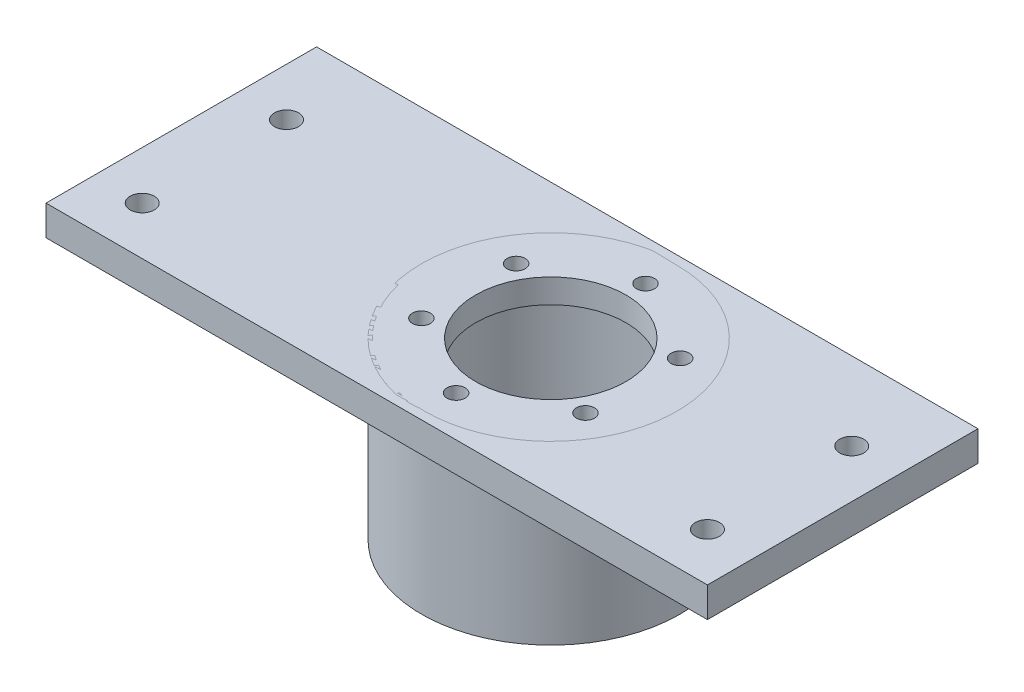
ISO-10303-21;
HEADER;
FILE_DESCRIPTION(('STEP AP214'),'2;1');
FILE_NAME('part.step','',(''),(''),'','','');
FILE_SCHEMA(('AUTOMOTIVE_DESIGN { 1 0 10303 214 1 1 1 1 }'));
ENDSEC;
DATA;
#1=APPLICATION_CONTEXT('core data for automotive mechanical design processes');
#2=APPLICATION_PROTOCOL_DEFINITION('international standard','automotive_design',2000,#1);
#3=PRODUCT_CONTEXT('',#1,'mechanical');
#4=PRODUCT('Part','Part','',(#3));
#5=PRODUCT_RELATED_PRODUCT_CATEGORY('part','',(#4));
#6=PRODUCT_DEFINITION_FORMATION('','',#4);
#7=PRODUCT_DEFINITION_CONTEXT('part definition',#1,'design');
#8=PRODUCT_DEFINITION('design','',#6,#7);
#9=PRODUCT_DEFINITION_SHAPE('','',#8);
#10=(LENGTH_UNIT() NAMED_UNIT(*) SI_UNIT(.MILLI.,.METRE.));
#11=(NAMED_UNIT(*) PLANE_ANGLE_UNIT() SI_UNIT($,.RADIAN.));
#12=(NAMED_UNIT(*) SI_UNIT($,.STERADIAN.) SOLID_ANGLE_UNIT());
#13=UNCERTAINTY_MEASURE_WITH_UNIT(LENGTH_MEASURE(1.E-05),#10,'distance_accuracy_value','');
#14=(GEOMETRIC_REPRESENTATION_CONTEXT(3) GLOBAL_UNCERTAINTY_ASSIGNED_CONTEXT((#13)) GLOBAL_UNIT_ASSIGNED_CONTEXT((#10,
#11,#12)) REPRESENTATION_CONTEXT('',''));
#15=CARTESIAN_POINT('',(0.,0.,0.));
#16=DIRECTION('',(0.,0.,1.));
#17=DIRECTION('',(1.,0.,0.));
#18=AXIS2_PLACEMENT_3D('',#15,#16,#17);
#19=CARTESIAN_POINT('',(0.,-24.,0.));
#20=DIRECTION('',(0.,-1.,0.));
#21=DIRECTION('',(1.,0.,0.));
#22=AXIS2_PLACEMENT_3D('',#19,#20,#21);
#23=PLANE('',#22);
#24=CARTESIAN_POINT('',(0.,-24.,0.));
#25=DIRECTION('',(0.,-1.,0.));
#26=DIRECTION('',(1.,0.,0.));
#27=AXIS2_PLACEMENT_3D('',#24,#25,#26);
#28=CIRCLE('',#27,21.5);
#29=CARTESIAN_POINT('',(21.5,-24.,0.));
#30=VERTEX_POINT('',#29);
#31=EDGE_CURVE('E11',#30,#30,#28,.T.);
#32=ORIENTED_EDGE('',*,*,#31,.T.);
#33=EDGE_LOOP('',(#32));
#34=FACE_BOUND('',#33,.T.);
#35=CARTESIAN_POINT('',(0.,-24.,0.));
#36=DIRECTION('',(0.,-1.,0.));
#37=DIRECTION('',(1.,0.,0.));
#38=AXIS2_PLACEMENT_3D('',#35,#36,#37);
#39=CIRCLE('',#38,19.);
#40=CARTESIAN_POINT('',(19.,-24.,0.));
#41=VERTEX_POINT('',#40);
#42=EDGE_CURVE('E54',#41,#41,#39,.T.);
#43=ORIENTED_EDGE('',*,*,#42,.F.);
#44=EDGE_LOOP('',(#43));
#45=FACE_BOUND('',#44,.T.);
#46=ADVANCED_FACE('F47',(#34,#45),#23,.T.);
#47=CARTESIAN_POINT('',(0.,-24.,0.));
#48=DIRECTION('',(0.,1.,0.));
#49=DIRECTION('',(-1.,0.,0.));
#50=AXIS2_PLACEMENT_3D('',#47,#48,#49);
#51=CYLINDRICAL_SURFACE('',#50,21.5);
#52=ORIENTED_EDGE('',*,*,#31,.F.);
#53=EDGE_LOOP('',(#52));
#54=FACE_BOUND('',#53,.T.);
#55=CARTESIAN_POINT('',(0.,5.,0.));
#56=DIRECTION('',(0.,1.,0.));
#57=DIRECTION('',(-1.,0.,0.));
#58=AXIS2_PLACEMENT_3D('',#55,#56,#57);
#59=CIRCLE('',#58,21.5);
#60=CARTESIAN_POINT('',(-21.5,5.,0.));
#61=VERTEX_POINT('',#60);
#62=EDGE_CURVE('E63',#61,#61,#59,.T.);
#63=ORIENTED_EDGE('',*,*,#62,.F.);
#64=EDGE_LOOP('',(#63));
#65=FACE_BOUND('',#64,.T.);
#66=ADVANCED_FACE('F49',(#54,#65),#51,.T.);
#67=CARTESIAN_POINT('',(0.,-24.,0.));
#68=DIRECTION('',(0.,1.,0.));
#69=DIRECTION('',(-1.,0.,0.));
#70=AXIS2_PLACEMENT_3D('',#67,#68,#69);
#71=CYLINDRICAL_SURFACE('',#70,19.);
#72=ORIENTED_EDGE('',*,*,#42,.T.);
#73=EDGE_LOOP('',(#72));
#74=FACE_BOUND('',#73,.T.);
#75=CARTESIAN_POINT('',(0.,1.,0.));
#76=DIRECTION('',(0.,-1.,0.));
#77=DIRECTION('',(1.,0.,0.));
#78=AXIS2_PLACEMENT_3D('',#75,#76,#77);
#79=CIRCLE('',#78,19.);
#80=CARTESIAN_POINT('',(19.,1.,0.));
#81=VERTEX_POINT('',#80);
#82=EDGE_CURVE('E58',#81,#81,#79,.T.);
#83=ORIENTED_EDGE('',*,*,#82,.F.);
#84=EDGE_LOOP('',(#83));
#85=FACE_BOUND('',#84,.T.);
#86=ADVANCED_FACE('F136',(#74,#85),#71,.F.);
#87=CARTESIAN_POINT('',(0.,1.,0.));
#88=DIRECTION('',(0.,1.,0.));
#89=DIRECTION('',(-1.,0.,0.));
#90=AXIS2_PLACEMENT_3D('',#87,#88,#89);
#91=PLANE('',#90);
#92=CARTESIAN_POINT('',(-13.6399001096048,1.,7.87500000000016));
#93=DIRECTION('',(0.,1.,0.));
#94=DIRECTION('',(-1.,0.,0.));
#95=AXIS2_PLACEMENT_3D('',#92,#93,#94);
#96=CIRCLE('',#95,1.5);
#97=CARTESIAN_POINT('',(-15.1399001096048,1.,7.87500000000016));
#98=VERTEX_POINT('',#97);
#99=EDGE_CURVE('E79',#98,#98,#96,.T.);
#100=ORIENTED_EDGE('',*,*,#99,.T.);
#101=EDGE_LOOP('',(#100));
#102=FACE_BOUND('',#101,.T.);
#103=CARTESIAN_POINT('',(-13.639900109605,1.,-7.87499999999987));
#104=DIRECTION('',(0.,1.,0.));
#105=DIRECTION('',(-1.,0.,0.));
#106=AXIS2_PLACEMENT_3D('',#103,#104,#105);
#107=CIRCLE('',#106,1.5);
#108=CARTESIAN_POINT('',(-15.139900109605,1.,-7.87499999999987));
#109=VERTEX_POINT('',#108);
#110=EDGE_CURVE('E82',#109,#109,#107,.T.);
#111=ORIENTED_EDGE('',*,*,#110,.T.);
#112=EDGE_LOOP('',(#111));
#113=FACE_BOUND('',#112,.T.);
#114=CARTESIAN_POINT('',(0.,1.,-15.75));
#115=DIRECTION('',(0.,1.,0.));
#116=DIRECTION('',(-1.,0.,0.));
#117=AXIS2_PLACEMENT_3D('',#114,#115,#116);
#118=CIRCLE('',#117,1.5);
#119=CARTESIAN_POINT('',(-1.5,1.,-15.75));
#120=VERTEX_POINT('',#119);
#121=EDGE_CURVE('E85',#120,#120,#118,.T.);
#122=ORIENTED_EDGE('',*,*,#121,.T.);
#123=EDGE_LOOP('',(#122));
#124=FACE_BOUND('',#123,.T.);
#125=CARTESIAN_POINT('',(13.6399001096049,1.,-7.87500000000006));
#126=DIRECTION('',(0.,1.,0.));
#127=DIRECTION('',(-1.,0.,0.));
#128=AXIS2_PLACEMENT_3D('',#125,#126,#127);
#129=CIRCLE('',#128,1.5);
#130=CARTESIAN_POINT('',(12.1399001096049,1.,-7.87500000000006));
#131=VERTEX_POINT('',#130);
#132=EDGE_CURVE('E88',#131,#131,#129,.T.);
#133=ORIENTED_EDGE('',*,*,#132,.T.);
#134=EDGE_LOOP('',(#133));
#135=FACE_BOUND('',#134,.T.);
#136=CARTESIAN_POINT('',(13.6399001096049,1.,7.87499999999997));
#137=DIRECTION('',(0.,1.,0.));
#138=DIRECTION('',(-1.,0.,0.));
#139=AXIS2_PLACEMENT_3D('',#136,#137,#138);
#140=CIRCLE('',#139,1.5);
#141=CARTESIAN_POINT('',(12.1399001096049,1.,7.87499999999997));
#142=VERTEX_POINT('',#141);
#143=EDGE_CURVE('E91',#142,#142,#140,.T.);
#144=ORIENTED_EDGE('',*,*,#143,.T.);
#145=EDGE_LOOP('',(#144));
#146=FACE_BOUND('',#145,.T.);
#147=CARTESIAN_POINT('',(0.,1.,15.75));
#148=DIRECTION('',(0.,1.,0.));
#149=DIRECTION('',(-1.,0.,0.));
#150=AXIS2_PLACEMENT_3D('',#147,#148,#149);
#151=CIRCLE('',#150,1.5);
#152=CARTESIAN_POINT('',(-1.5,1.,15.75));
#153=VERTEX_POINT('',#152);
#154=EDGE_CURVE('E71',#153,#153,#151,.T.);
#155=ORIENTED_EDGE('',*,*,#154,.T.);
#156=EDGE_LOOP('',(#155));
#157=FACE_BOUND('',#156,.T.);
#158=CARTESIAN_POINT('',(0.,1.,0.));
#159=DIRECTION('',(0.,1.,0.));
#160=DIRECTION('',(-1.,0.,0.));
#161=AXIS2_PLACEMENT_3D('',#158,#159,#160);
#162=CIRCLE('',#161,12.5);
#163=CARTESIAN_POINT('',(-12.5,1.,0.));
#164=VERTEX_POINT('',#163);
#165=EDGE_CURVE('E68',#164,#164,#162,.T.);
#166=ORIENTED_EDGE('',*,*,#165,.T.);
#167=EDGE_LOOP('',(#166));
#168=FACE_BOUND('',#167,.T.);
#169=ORIENTED_EDGE('',*,*,#82,.T.);
#170=EDGE_LOOP('',(#169));
#171=FACE_BOUND('',#170,.T.);
#172=ADVANCED_FACE('F117',(#102,#113,#124,#135,#146,#157,#168,#171),#91,.F.);
#173=CARTESIAN_POINT('',(0.,5.,0.));
#174=DIRECTION('',(0.,1.,0.));
#175=DIRECTION('',(-1.,0.,0.));
#176=AXIS2_PLACEMENT_3D('',#173,#174,#175);
#177=PLANE('',#176);
#178=CARTESIAN_POINT('',(-13.6399001096048,5.,7.87500000000016));
#179=DIRECTION('',(0.,1.,0.));
#180=DIRECTION('',(-0.50000000000001,0.,-0.866025403784433));
#181=AXIS2_PLACEMENT_3D('',#178,#179,#180);
#182=CIRCLE('',#181,1.5);
#183=CARTESIAN_POINT('',(-14.3899001096048,5.,6.57596189432351));
#184=VERTEX_POINT('',#183);
#185=EDGE_CURVE('E98',#184,#184,#182,.T.);
#186=ORIENTED_EDGE('',*,*,#185,.F.);
#187=EDGE_LOOP('',(#186));
#188=FACE_BOUND('',#187,.T.);
#189=CARTESIAN_POINT('',(-13.639900109605,5.,-7.87499999999987));
#190=DIRECTION('',(0.,1.,0.));
#191=DIRECTION('',(0.499999999999992,0.,-0.866025403784443));
#192=AXIS2_PLACEMENT_3D('',#189,#190,#191);
#193=CIRCLE('',#192,1.5);
#194=CARTESIAN_POINT('',(-12.889900109605,5.,-9.17403810567654));
#195=VERTEX_POINT('',#194);
#196=EDGE_CURVE('E101',#195,#195,#193,.T.);
#197=ORIENTED_EDGE('',*,*,#196,.F.);
#198=EDGE_LOOP('',(#197));
#199=FACE_BOUND('',#198,.T.);
#200=CARTESIAN_POINT('',(0.,5.,-15.75));
#201=DIRECTION('',(0.,1.,0.));
#202=DIRECTION('',(1.,0.,0.));
#203=AXIS2_PLACEMENT_3D('',#200,#201,#202);
#204=CIRCLE('',#203,1.5);
#205=CARTESIAN_POINT('',(1.5,5.,-15.75));
#206=VERTEX_POINT('',#205);
#207=EDGE_CURVE('E104',#206,#206,#204,.T.);
#208=ORIENTED_EDGE('',*,*,#207,.F.);
#209=EDGE_LOOP('',(#208));
#210=FACE_BOUND('',#209,.T.);
#211=CARTESIAN_POINT('',(13.6399001096049,5.,-7.87500000000006));
#212=DIRECTION('',(0.,1.,0.));
#213=DIRECTION('',(0.500000000000004,0.,0.866025403784436));
#214=AXIS2_PLACEMENT_3D('',#211,#212,#213);
#215=CIRCLE('',#214,1.5);
#216=CARTESIAN_POINT('',(14.3899001096049,5.,-6.57596189432341));
#217=VERTEX_POINT('',#216);
#218=EDGE_CURVE('E97',#217,#217,#215,.T.);
#219=ORIENTED_EDGE('',*,*,#218,.F.);
#220=EDGE_LOOP('',(#219));
#221=FACE_BOUND('',#220,.T.);
#222=CARTESIAN_POINT('',(13.6399001096049,5.,7.87499999999997));
#223=DIRECTION('',(0.,1.,0.));
#224=DIRECTION('',(-0.499999999999998,0.,0.86602540378444));
#225=AXIS2_PLACEMENT_3D('',#222,#223,#224);
#226=CIRCLE('',#225,1.5);
#227=CARTESIAN_POINT('',(12.8899001096049,5.,9.17403810567663));
#228=VERTEX_POINT('',#227);
#229=EDGE_CURVE('E94',#228,#228,#226,.T.);
#230=ORIENTED_EDGE('',*,*,#229,.F.);
#231=EDGE_LOOP('',(#230));
#232=FACE_BOUND('',#231,.T.);
#233=CARTESIAN_POINT('',(0.,5.,15.75));
#234=DIRECTION('',(0.,1.,0.));
#235=DIRECTION('',(-1.,0.,0.));
#236=AXIS2_PLACEMENT_3D('',#233,#234,#235);
#237=CIRCLE('',#236,1.5);
#238=CARTESIAN_POINT('',(-1.5,5.,15.75));
#239=VERTEX_POINT('',#238);
#240=EDGE_CURVE('E76',#239,#239,#237,.T.);
#241=ORIENTED_EDGE('',*,*,#240,.F.);
#242=EDGE_LOOP('',(#241));
#243=FACE_BOUND('',#242,.T.);
#244=ORIENTED_EDGE('',*,*,#62,.T.);
#245=EDGE_LOOP('',(#244));
#246=FACE_BOUND('',#245,.T.);
#247=CARTESIAN_POINT('',(0.,5.,0.));
#248=DIRECTION('',(0.,1.,0.));
#249=DIRECTION('',(-1.,0.,0.));
#250=AXIS2_PLACEMENT_3D('',#247,#248,#249);
#251=CIRCLE('',#250,12.5);
#252=CARTESIAN_POINT('',(-12.5,5.,0.));
#253=VERTEX_POINT('',#252);
#254=EDGE_CURVE('E67',#253,#253,#251,.T.);
#255=ORIENTED_EDGE('',*,*,#254,.F.);
#256=EDGE_LOOP('',(#255));
#257=FACE_BOUND('',#256,.T.);
#258=ADVANCED_FACE('F113',(#188,#199,#210,#221,#232,#243,#246,#257),#177,.T.);
#259=CARTESIAN_POINT('',(0.,5.,0.));
#260=DIRECTION('',(0.,-1.,0.));
#261=DIRECTION('',(1.,0.,0.));
#262=AXIS2_PLACEMENT_3D('',#259,#260,#261);
#263=CYLINDRICAL_SURFACE('',#262,12.5);
#264=ORIENTED_EDGE('',*,*,#254,.T.);
#265=EDGE_LOOP('',(#264));
#266=FACE_BOUND('',#265,.T.);
#267=ORIENTED_EDGE('',*,*,#165,.F.);
#268=EDGE_LOOP('',(#267));
#269=FACE_BOUND('',#268,.T.);
#270=ADVANCED_FACE('F116',(#266,#269),#263,.F.);
#271=CARTESIAN_POINT('',(0.,0.,15.75));
#272=DIRECTION('',(0.,1.,0.));
#273=DIRECTION('',(-1.,0.,0.));
#274=AXIS2_PLACEMENT_3D('',#271,#272,#273);
#275=CYLINDRICAL_SURFACE('',#274,1.5);
#276=ORIENTED_EDGE('',*,*,#240,.T.);
#277=EDGE_LOOP('',(#276));
#278=FACE_BOUND('',#277,.T.);
#279=ORIENTED_EDGE('',*,*,#154,.F.);
#280=EDGE_LOOP('',(#279));
#281=FACE_BOUND('',#280,.T.);
#282=ADVANCED_FACE('F130',(#278,#281),#275,.F.);
#283=CARTESIAN_POINT('',(13.6399001096049,0.,7.87499999999997));
#284=DIRECTION('',(0.,1.,0.));
#285=DIRECTION('',(-1.,0.,0.));
#286=AXIS2_PLACEMENT_3D('',#283,#284,#285);
#287=CYLINDRICAL_SURFACE('',#286,1.5);
#288=ORIENTED_EDGE('',*,*,#229,.T.);
#289=EDGE_LOOP('',(#288));
#290=FACE_BOUND('',#289,.T.);
#291=ORIENTED_EDGE('',*,*,#143,.F.);
#292=EDGE_LOOP('',(#291));
#293=FACE_BOUND('',#292,.T.);
#294=ADVANCED_FACE('F187',(#290,#293),#287,.F.);
#295=CARTESIAN_POINT('',(13.6399001096049,0.,-7.87500000000006));
#296=DIRECTION('',(0.,1.,0.));
#297=DIRECTION('',(-1.,0.,0.));
#298=AXIS2_PLACEMENT_3D('',#295,#296,#297);
#299=CYLINDRICAL_SURFACE('',#298,1.5);
#300=ORIENTED_EDGE('',*,*,#218,.T.);
#301=EDGE_LOOP('',(#300));
#302=FACE_BOUND('',#301,.T.);
#303=ORIENTED_EDGE('',*,*,#132,.F.);
#304=EDGE_LOOP('',(#303));
#305=FACE_BOUND('',#304,.T.);
#306=ADVANCED_FACE('F110',(#302,#305),#299,.F.);
#307=CARTESIAN_POINT('',(0.,0.,-15.75));
#308=DIRECTION('',(0.,1.,0.));
#309=DIRECTION('',(-1.,0.,0.));
#310=AXIS2_PLACEMENT_3D('',#307,#308,#309);
#311=CYLINDRICAL_SURFACE('',#310,1.5);
#312=ORIENTED_EDGE('',*,*,#207,.T.);
#313=EDGE_LOOP('',(#312));
#314=FACE_BOUND('',#313,.T.);
#315=ORIENTED_EDGE('',*,*,#121,.F.);
#316=EDGE_LOOP('',(#315));
#317=FACE_BOUND('',#316,.T.);
#318=ADVANCED_FACE('F206',(#314,#317),#311,.F.);
#319=CARTESIAN_POINT('',(-13.639900109605,0.,-7.87499999999987));
#320=DIRECTION('',(0.,1.,0.));
#321=DIRECTION('',(-1.,0.,0.));
#322=AXIS2_PLACEMENT_3D('',#319,#320,#321);
#323=CYLINDRICAL_SURFACE('',#322,1.5);
#324=ORIENTED_EDGE('',*,*,#196,.T.);
#325=EDGE_LOOP('',(#324));
#326=FACE_BOUND('',#325,.T.);
#327=ORIENTED_EDGE('',*,*,#110,.F.);
#328=EDGE_LOOP('',(#327));
#329=FACE_BOUND('',#328,.T.);
#330=ADVANCED_FACE('F215',(#326,#329),#323,.F.);
#331=CARTESIAN_POINT('',(-13.6399001096048,0.,7.87500000000016));
#332=DIRECTION('',(0.,1.,0.));
#333=DIRECTION('',(-1.,0.,0.));
#334=AXIS2_PLACEMENT_3D('',#331,#332,#333);
#335=CYLINDRICAL_SURFACE('',#334,1.5);
#336=ORIENTED_EDGE('',*,*,#185,.T.);
#337=EDGE_LOOP('',(#336));
#338=FACE_BOUND('',#337,.T.);
#339=ORIENTED_EDGE('',*,*,#99,.F.);
#340=EDGE_LOOP('',(#339));
#341=FACE_BOUND('',#340,.T.);
#342=ADVANCED_FACE('F225',(#338,#341),#335,.F.);
#343=CLOSED_SHELL('',(#46,#66,#86,#172,#258,#270,#282,#294,#306,#318,#330,#342));
#344=MANIFOLD_SOLID_BREP('B2',#343);
#345=CARTESIAN_POINT('',(48.55,5.,-22.5));
#346=DIRECTION('',(-1.,0.,0.));
#347=DIRECTION('',(0.,0.,1.));
#348=AXIS2_PLACEMENT_3D('',#345,#346,#347);
#349=PLANE('',#348);
#350=DIRECTION('',(0.,0.,-1.));
#351=VECTOR('',#350,1.);
#352=CARTESIAN_POINT('',(48.55,0.,-22.5));
#353=LINE('',#352,#351);
#354=CARTESIAN_POINT('',(48.55,0.,22.5));
#355=VERTEX_POINT('',#354);
#356=CARTESIAN_POINT('',(48.55,0.,-22.5));
#357=VERTEX_POINT('',#356);
#358=EDGE_CURVE('E330',#355,#357,#353,.T.);
#359=ORIENTED_EDGE('',*,*,#358,.T.);
#360=DIRECTION('',(0.,-1.,0.));
#361=VECTOR('',#360,1.);
#362=CARTESIAN_POINT('',(48.55,5.,-22.5));
#363=LINE('',#362,#361);
#364=CARTESIAN_POINT('',(48.55,5.,-22.5));
#365=VERTEX_POINT('',#364);
#366=EDGE_CURVE('E45',#365,#357,#363,.T.);
#367=ORIENTED_EDGE('',*,*,#366,.F.);
#368=DIRECTION('',(0.,0.,-1.));
#369=VECTOR('',#368,1.);
#370=CARTESIAN_POINT('',(48.55,5.,-22.5));
#371=LINE('',#370,#369);
#372=CARTESIAN_POINT('',(48.55,5.,22.5));
#373=VERTEX_POINT('',#372);
#374=EDGE_CURVE('E318',#373,#365,#371,.T.);
#375=ORIENTED_EDGE('',*,*,#374,.F.);
#376=DIRECTION('',(0.,-1.,0.));
#377=VECTOR('',#376,1.);
#378=CARTESIAN_POINT('',(48.55,5.,22.5));
#379=LINE('',#378,#377);
#380=EDGE_CURVE('E326',#373,#355,#379,.T.);
#381=ORIENTED_EDGE('',*,*,#380,.T.);
#382=EDGE_LOOP('',(#359,#367,#375,#381));
#383=FACE_BOUND('',#382,.T.);
#384=ADVANCED_FACE('F267',(#383),#349,.F.);
#385=CARTESIAN_POINT('',(-61.45,5.,-22.5));
#386=DIRECTION('',(0.,0.,1.));
#387=DIRECTION('',(1.,0.,0.));
#388=AXIS2_PLACEMENT_3D('',#385,#386,#387);
#389=PLANE('',#388);
#390=DIRECTION('',(-1.,0.,0.));
#391=VECTOR('',#390,1.);
#392=CARTESIAN_POINT('',(-61.45,0.,-22.5));
#393=LINE('',#392,#391);
#394=CARTESIAN_POINT('',(-61.45,0.,-22.5));
#395=VERTEX_POINT('',#394);
#396=EDGE_CURVE('E322',#357,#395,#393,.T.);
#397=ORIENTED_EDGE('',*,*,#396,.T.);
#398=DIRECTION('',(0.,-1.,0.));
#399=VECTOR('',#398,1.);
#400=CARTESIAN_POINT('',(-61.45,5.,-22.5));
#401=LINE('',#400,#399);
#402=CARTESIAN_POINT('',(-61.45,5.,-22.5));
#403=VERTEX_POINT('',#402);
#404=EDGE_CURVE('E275',#403,#395,#401,.T.);
#405=ORIENTED_EDGE('',*,*,#404,.F.);
#406=DIRECTION('',(-1.,0.,0.));
#407=VECTOR('',#406,1.);
#408=CARTESIAN_POINT('',(-61.45,5.,-22.5));
#409=LINE('',#408,#407);
#410=EDGE_CURVE('E313',#365,#403,#409,.T.);
#411=ORIENTED_EDGE('',*,*,#410,.F.);
#412=ORIENTED_EDGE('',*,*,#366,.T.);
#413=EDGE_LOOP('',(#397,#405,#411,#412));
#414=FACE_BOUND('',#413,.T.);
#415=ADVANCED_FACE('F321',(#414),#389,.F.);
#416=CARTESIAN_POINT('',(-61.45,5.,-22.5));
#417=DIRECTION('',(1.,0.,0.));
#418=DIRECTION('',(0.,0.,-1.));
#419=AXIS2_PLACEMENT_3D('',#416,#417,#418);
#420=PLANE('',#419);
#421=DIRECTION('',(0.,0.,1.));
#422=VECTOR('',#421,1.);
#423=CARTESIAN_POINT('',(-61.45,0.,-22.5));
#424=LINE('',#423,#422);
#425=CARTESIAN_POINT('',(-61.45,0.,22.5));
#426=VERTEX_POINT('',#425);
#427=EDGE_CURVE('E300',#395,#426,#424,.T.);
#428=ORIENTED_EDGE('',*,*,#427,.T.);
#429=DIRECTION('',(0.,-1.,0.));
#430=VECTOR('',#429,1.);
#431=CARTESIAN_POINT('',(-61.45,5.,22.5));
#432=LINE('',#431,#430);
#433=CARTESIAN_POINT('',(-61.45,5.,22.5));
#434=VERTEX_POINT('',#433);
#435=EDGE_CURVE('E323',#434,#426,#432,.T.);
#436=ORIENTED_EDGE('',*,*,#435,.F.);
#437=DIRECTION('',(0.,0.,1.));
#438=VECTOR('',#437,1.);
#439=CARTESIAN_POINT('',(-61.45,5.,-22.5));
#440=LINE('',#439,#438);
#441=EDGE_CURVE('E316',#403,#434,#440,.T.);
#442=ORIENTED_EDGE('',*,*,#441,.F.);
#443=ORIENTED_EDGE('',*,*,#404,.T.);
#444=EDGE_LOOP('',(#428,#436,#442,#443));
#445=FACE_BOUND('',#444,.T.);
#446=ADVANCED_FACE('F324',(#445),#420,.F.);
#447=CARTESIAN_POINT('',(-61.45,5.,22.5));
#448=DIRECTION('',(0.,0.,-1.));
#449=DIRECTION('',(-1.,0.,0.));
#450=AXIS2_PLACEMENT_3D('',#447,#448,#449);
#451=PLANE('',#450);
#452=DIRECTION('',(1.,0.,0.));
#453=VECTOR('',#452,1.);
#454=CARTESIAN_POINT('',(-61.45,0.,22.5));
#455=LINE('',#454,#453);
#456=EDGE_CURVE('E306',#426,#355,#455,.T.);
#457=ORIENTED_EDGE('',*,*,#456,.T.);
#458=ORIENTED_EDGE('',*,*,#380,.F.);
#459=DIRECTION('',(1.,0.,0.));
#460=VECTOR('',#459,1.);
#461=CARTESIAN_POINT('',(-61.45,5.,22.5));
#462=LINE('',#461,#460);
#463=EDGE_CURVE('E283',#434,#373,#462,.T.);
#464=ORIENTED_EDGE('',*,*,#463,.F.);
#465=ORIENTED_EDGE('',*,*,#435,.T.);
#466=EDGE_LOOP('',(#457,#458,#464,#465));
#467=FACE_BOUND('',#466,.T.);
#468=ADVANCED_FACE('F338',(#467),#451,.F.);
#469=CARTESIAN_POINT('',(0.,5.,0.));
#470=DIRECTION('',(0.,1.,0.));
#471=DIRECTION('',(0.,0.,1.));
#472=AXIS2_PLACEMENT_3D('',#469,#470,#471);
#473=PLANE('',#472);
#474=CARTESIAN_POINT('',(-53.45,5.,14.5));
#475=DIRECTION('',(0.,1.,0.));
#476=DIRECTION('',(0.,0.,1.));
#477=AXIS2_PLACEMENT_3D('',#474,#475,#476);
#478=CIRCLE('',#477,2.);
#479=CARTESIAN_POINT('',(-53.45,5.,16.5));
#480=VERTEX_POINT('',#479);
#481=EDGE_CURVE('E368',#480,#480,#478,.T.);
#482=ORIENTED_EDGE('',*,*,#481,.F.);
#483=EDGE_LOOP('',(#482));
#484=FACE_BOUND('',#483,.T.);
#485=CARTESIAN_POINT('',(-53.45,5.,-9.5));
#486=DIRECTION('',(0.,1.,0.));
#487=DIRECTION('',(0.,0.,1.));
#488=AXIS2_PLACEMENT_3D('',#485,#486,#487);
#489=CIRCLE('',#488,2.);
#490=CARTESIAN_POINT('',(-53.45,5.,-7.5));
#491=VERTEX_POINT('',#490);
#492=EDGE_CURVE('E362',#491,#491,#489,.T.);
#493=ORIENTED_EDGE('',*,*,#492,.F.);
#494=EDGE_LOOP('',(#493));
#495=FACE_BOUND('',#494,.T.);
#496=CARTESIAN_POINT('',(40.55,5.,14.5));
#497=DIRECTION('',(0.,1.,0.));
#498=DIRECTION('',(0.,0.,1.));
#499=AXIS2_PLACEMENT_3D('',#496,#497,#498);
#500=CIRCLE('',#499,2.);
#501=CARTESIAN_POINT('',(40.55,5.,16.5));
#502=VERTEX_POINT('',#501);
#503=EDGE_CURVE('E357',#502,#502,#500,.T.);
#504=ORIENTED_EDGE('',*,*,#503,.F.);
#505=EDGE_LOOP('',(#504));
#506=FACE_BOUND('',#505,.T.);
#507=CARTESIAN_POINT('',(40.55,5.,-9.5));
#508=DIRECTION('',(0.,1.,0.));
#509=DIRECTION('',(0.,0.,1.));
#510=AXIS2_PLACEMENT_3D('',#507,#508,#509);
#511=CIRCLE('',#510,2.);
#512=CARTESIAN_POINT('',(40.55,5.,-7.5));
#513=VERTEX_POINT('',#512);
#514=EDGE_CURVE('E350',#513,#513,#511,.T.);
#515=ORIENTED_EDGE('',*,*,#514,.F.);
#516=EDGE_LOOP('',(#515));
#517=FACE_BOUND('',#516,.T.);
#518=CARTESIAN_POINT('',(0.,5.,0.));
#519=DIRECTION('',(0.,1.,0.));
#520=DIRECTION('',(0.,0.,1.));
#521=AXIS2_PLACEMENT_3D('',#518,#519,#520);
#522=CIRCLE('',#521,21.);
#523=CARTESIAN_POINT('',(0.,5.,21.));
#524=VERTEX_POINT('',#523);
#525=EDGE_CURVE('E344',#524,#524,#522,.T.);
#526=ORIENTED_EDGE('',*,*,#525,.F.);
#527=EDGE_LOOP('',(#526));
#528=FACE_BOUND('',#527,.T.);
#529=ORIENTED_EDGE('',*,*,#374,.T.);
#530=ORIENTED_EDGE('',*,*,#410,.T.);
#531=ORIENTED_EDGE('',*,*,#441,.T.);
#532=ORIENTED_EDGE('',*,*,#463,.T.);
#533=EDGE_LOOP('',(#529,#530,#531,#532));
#534=FACE_BOUND('',#533,.T.);
#535=ADVANCED_FACE('F314',(#484,#495,#506,#517,#528,#534),#473,.T.);
#536=CARTESIAN_POINT('',(0.,0.,0.));
#537=DIRECTION('',(0.,1.,0.));
#538=DIRECTION('',(0.,0.,1.));
#539=AXIS2_PLACEMENT_3D('',#536,#537,#538);
#540=PLANE('',#539);
#541=CARTESIAN_POINT('',(-53.45,0.,14.5));
#542=DIRECTION('',(0.,1.,0.));
#543=DIRECTION('',(0.,0.,1.));
#544=AXIS2_PLACEMENT_3D('',#541,#542,#543);
#545=CIRCLE('',#544,2.);
#546=CARTESIAN_POINT('',(-53.45,0.,16.5));
#547=VERTEX_POINT('',#546);
#548=EDGE_CURVE('E354',#547,#547,#545,.T.);
#549=ORIENTED_EDGE('',*,*,#548,.T.);
#550=EDGE_LOOP('',(#549));
#551=FACE_BOUND('',#550,.T.);
#552=CARTESIAN_POINT('',(-53.45,0.,-9.5));
#553=DIRECTION('',(0.,1.,0.));
#554=DIRECTION('',(0.,0.,1.));
#555=AXIS2_PLACEMENT_3D('',#552,#553,#554);
#556=CIRCLE('',#555,2.);
#557=CARTESIAN_POINT('',(-53.45,0.,-7.5));
#558=VERTEX_POINT('',#557);
#559=EDGE_CURVE('E365',#558,#558,#556,.T.);
#560=ORIENTED_EDGE('',*,*,#559,.T.);
#561=EDGE_LOOP('',(#560));
#562=FACE_BOUND('',#561,.T.);
#563=CARTESIAN_POINT('',(40.55,0.,14.5));
#564=DIRECTION('',(0.,1.,0.));
#565=DIRECTION('',(0.,0.,1.));
#566=AXIS2_PLACEMENT_3D('',#563,#564,#565);
#567=CIRCLE('',#566,2.);
#568=CARTESIAN_POINT('',(40.55,0.,16.5));
#569=VERTEX_POINT('',#568);
#570=EDGE_CURVE('E347',#569,#569,#567,.T.);
#571=ORIENTED_EDGE('',*,*,#570,.T.);
#572=EDGE_LOOP('',(#571));
#573=FACE_BOUND('',#572,.T.);
#574=CARTESIAN_POINT('',(40.55,0.,-9.5));
#575=DIRECTION('',(0.,1.,0.));
#576=DIRECTION('',(0.,0.,1.));
#577=AXIS2_PLACEMENT_3D('',#574,#575,#576);
#578=CIRCLE('',#577,2.);
#579=CARTESIAN_POINT('',(40.55,0.,-7.5));
#580=VERTEX_POINT('',#579);
#581=EDGE_CURVE('E353',#580,#580,#578,.T.);
#582=ORIENTED_EDGE('',*,*,#581,.T.);
#583=EDGE_LOOP('',(#582));
#584=FACE_BOUND('',#583,.T.);
#585=CARTESIAN_POINT('',(0.,0.,0.));
#586=DIRECTION('',(0.,1.,0.));
#587=DIRECTION('',(0.,0.,1.));
#588=AXIS2_PLACEMENT_3D('',#585,#586,#587);
#589=CIRCLE('',#588,21.);
#590=CARTESIAN_POINT('',(0.,0.,21.));
#591=VERTEX_POINT('',#590);
#592=EDGE_CURVE('E333',#591,#591,#589,.T.);
#593=ORIENTED_EDGE('',*,*,#592,.T.);
#594=EDGE_LOOP('',(#593));
#595=FACE_BOUND('',#594,.T.);
#596=ORIENTED_EDGE('',*,*,#358,.F.);
#597=ORIENTED_EDGE('',*,*,#456,.F.);
#598=ORIENTED_EDGE('',*,*,#427,.F.);
#599=ORIENTED_EDGE('',*,*,#396,.F.);
#600=EDGE_LOOP('',(#596,#597,#598,#599));
#601=FACE_BOUND('',#600,.T.);
#602=ADVANCED_FACE('F341',(#551,#562,#573,#584,#595,#601),#540,.F.);
#603=CARTESIAN_POINT('',(0.,0.,0.));
#604=DIRECTION('',(0.,1.,0.));
#605=DIRECTION('',(0.,0.,1.));
#606=AXIS2_PLACEMENT_3D('',#603,#604,#605);
#607=CYLINDRICAL_SURFACE('',#606,21.);
#608=ORIENTED_EDGE('',*,*,#592,.F.);
#609=EDGE_LOOP('',(#608));
#610=FACE_BOUND('',#609,.T.);
#611=ORIENTED_EDGE('',*,*,#525,.T.);
#612=EDGE_LOOP('',(#611));
#613=FACE_BOUND('',#612,.T.);
#614=ADVANCED_FACE('F394',(#610,#613),#607,.F.);
#615=CARTESIAN_POINT('',(40.55,0.,-9.5));
#616=DIRECTION('',(0.,1.,0.));
#617=DIRECTION('',(0.,0.,1.));
#618=AXIS2_PLACEMENT_3D('',#615,#616,#617);
#619=CYLINDRICAL_SURFACE('',#618,2.);
#620=ORIENTED_EDGE('',*,*,#581,.F.);
#621=EDGE_LOOP('',(#620));
#622=FACE_BOUND('',#621,.T.);
#623=ORIENTED_EDGE('',*,*,#514,.T.);
#624=EDGE_LOOP('',(#623));
#625=FACE_BOUND('',#624,.T.);
#626=ADVANCED_FACE('F396',(#622,#625),#619,.F.);
#627=CARTESIAN_POINT('',(40.55,0.,14.5));
#628=DIRECTION('',(0.,1.,0.));
#629=DIRECTION('',(0.,0.,1.));
#630=AXIS2_PLACEMENT_3D('',#627,#628,#629);
#631=CYLINDRICAL_SURFACE('',#630,2.);
#632=ORIENTED_EDGE('',*,*,#570,.F.);
#633=EDGE_LOOP('',(#632));
#634=FACE_BOUND('',#633,.T.);
#635=ORIENTED_EDGE('',*,*,#503,.T.);
#636=EDGE_LOOP('',(#635));
#637=FACE_BOUND('',#636,.T.);
#638=ADVANCED_FACE('F403',(#634,#637),#631,.F.);
#639=CARTESIAN_POINT('',(-53.45,0.,-9.5));
#640=DIRECTION('',(0.,1.,0.));
#641=DIRECTION('',(0.,0.,1.));
#642=AXIS2_PLACEMENT_3D('',#639,#640,#641);
#643=CYLINDRICAL_SURFACE('',#642,2.);
#644=ORIENTED_EDGE('',*,*,#559,.F.);
#645=EDGE_LOOP('',(#644));
#646=FACE_BOUND('',#645,.T.);
#647=ORIENTED_EDGE('',*,*,#492,.T.);
#648=EDGE_LOOP('',(#647));
#649=FACE_BOUND('',#648,.T.);
#650=ADVANCED_FACE('F379',(#646,#649),#643,.F.);
#651=CARTESIAN_POINT('',(-53.45,0.,14.5));
#652=DIRECTION('',(0.,1.,0.));
#653=DIRECTION('',(0.,0.,1.));
#654=AXIS2_PLACEMENT_3D('',#651,#652,#653);
#655=CYLINDRICAL_SURFACE('',#654,2.);
#656=ORIENTED_EDGE('',*,*,#548,.F.);
#657=EDGE_LOOP('',(#656));
#658=FACE_BOUND('',#657,.T.);
#659=ORIENTED_EDGE('',*,*,#481,.T.);
#660=EDGE_LOOP('',(#659));
#661=FACE_BOUND('',#660,.T.);
#662=ADVANCED_FACE('F376',(#658,#661),#655,.F.);
#663=CLOSED_SHELL('',(#384,#415,#446,#468,#535,#602,#614,#626,#638,#650,#662));
#664=MANIFOLD_SOLID_BREP('B6',#663);
#665=ADVANCED_BREP_SHAPE_REPRESENTATION('',(#18,#344,#664),#14);
#666=SHAPE_DEFINITION_REPRESENTATION(#9,#665);
ENDSEC;
END-ISO-10303-21;
